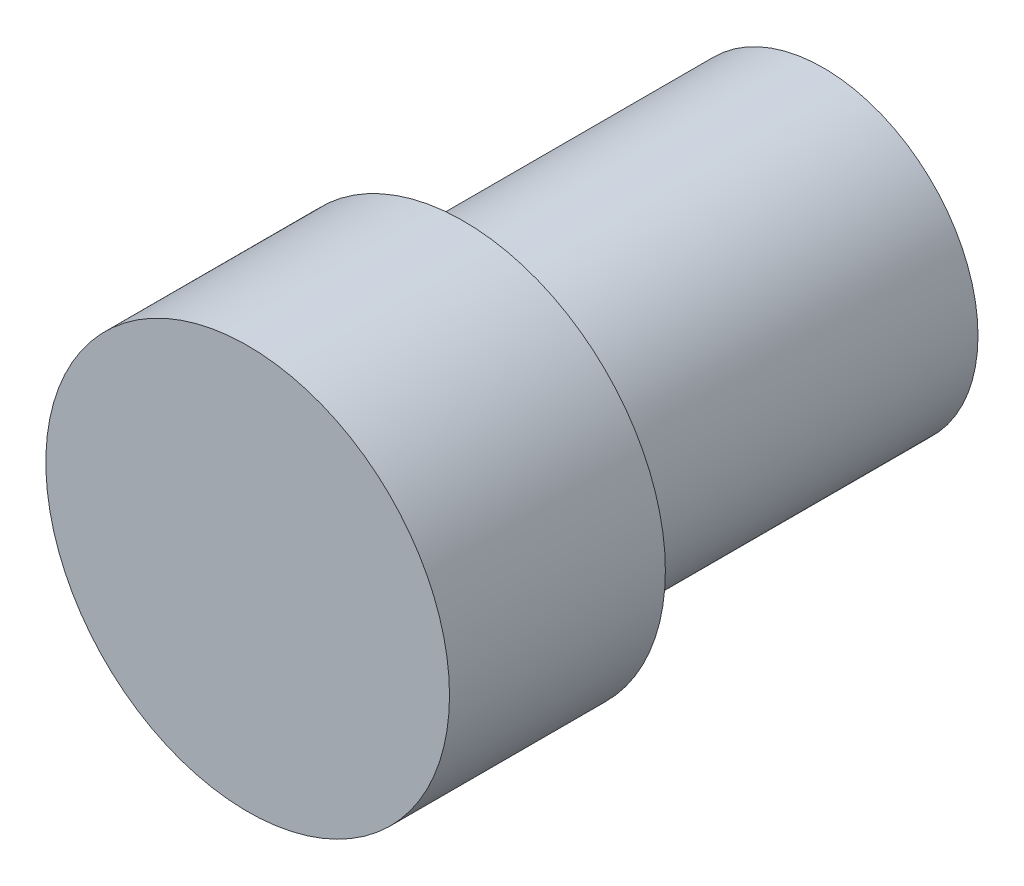
ISO-10303-21;
HEADER;
FILE_DESCRIPTION(('STEP AP214'),'2;1');
FILE_NAME('part.step','',(''),(''),'','','');
FILE_SCHEMA(('AUTOMOTIVE_DESIGN { 1 0 10303 214 1 1 1 1 }'));
ENDSEC;
DATA;
#1=APPLICATION_CONTEXT('core data for automotive mechanical design processes');
#2=APPLICATION_PROTOCOL_DEFINITION('international standard','automotive_design',2000,#1);
#3=PRODUCT_CONTEXT('',#1,'mechanical');
#4=PRODUCT('Part','Part','',(#3));
#5=PRODUCT_RELATED_PRODUCT_CATEGORY('part','',(#4));
#6=PRODUCT_DEFINITION_FORMATION('','',#4);
#7=PRODUCT_DEFINITION_CONTEXT('part definition',#1,'design');
#8=PRODUCT_DEFINITION('design','',#6,#7);
#9=PRODUCT_DEFINITION_SHAPE('','',#8);
#10=(LENGTH_UNIT() NAMED_UNIT(*) SI_UNIT(.MILLI.,.METRE.));
#11=(NAMED_UNIT(*) PLANE_ANGLE_UNIT() SI_UNIT($,.RADIAN.));
#12=(NAMED_UNIT(*) SI_UNIT($,.STERADIAN.) SOLID_ANGLE_UNIT());
#13=UNCERTAINTY_MEASURE_WITH_UNIT(LENGTH_MEASURE(1.E-05),#10,'distance_accuracy_value','');
#14=(GEOMETRIC_REPRESENTATION_CONTEXT(3) GLOBAL_UNCERTAINTY_ASSIGNED_CONTEXT((#13)) GLOBAL_UNIT_ASSIGNED_CONTEXT((#10,
#11,#12)) REPRESENTATION_CONTEXT('',''));
#15=CARTESIAN_POINT('',(0.,0.,0.));
#16=DIRECTION('',(0.,0.,1.));
#17=DIRECTION('',(1.,0.,0.));
#18=AXIS2_PLACEMENT_3D('',#15,#16,#17);
#19=CARTESIAN_POINT('',(0.,0.,12.7));
#20=DIRECTION('',(0.,0.,-0.999999999999999));
#21=DIRECTION('',(-0.999999999999997,0.,0.));
#22=AXIS2_PLACEMENT_3D('',#19,#20,#21);
#23=CYLINDRICAL_SURFACE('',#22,5.461);
#24=CARTESIAN_POINT('',(0.,0.,12.7));
#25=DIRECTION('',(0.,0.,0.999999999999999));
#26=DIRECTION('',(0.999999999999997,0.,0.));
#27=AXIS2_PLACEMENT_3D('',#24,#25,#26);
#28=CIRCLE('',#27,5.461);
#29=CARTESIAN_POINT('',(5.46099999999995,0.,12.7));
#30=VERTEX_POINT('',#29);
#31=EDGE_CURVE('E12',#30,#30,#28,.T.);
#32=ORIENTED_EDGE('',*,*,#31,.F.);
#33=EDGE_LOOP('',(#32));
#34=FACE_BOUND('',#33,.T.);
#35=CARTESIAN_POINT('',(0.,0.,0.));
#36=DIRECTION('',(0.,0.,0.999999999999999));
#37=DIRECTION('',(0.999999999999997,0.,0.));
#38=AXIS2_PLACEMENT_3D('',#35,#36,#37);
#39=CIRCLE('',#38,5.461);
#40=CARTESIAN_POINT('',(5.46099999999998,0.,0.));
#41=VERTEX_POINT('',#40);
#42=EDGE_CURVE('E49',#41,#41,#39,.T.);
#43=ORIENTED_EDGE('',*,*,#42,.T.);
#44=EDGE_LOOP('',(#43));
#45=FACE_BOUND('',#44,.T.);
#46=ADVANCED_FACE('F46',(#34,#45),#23,.T.);
#47=CARTESIAN_POINT('',(0.,0.,0.));
#48=DIRECTION('',(0.,0.,0.999999999999999));
#49=DIRECTION('',(0.999999999999997,0.,0.));
#50=AXIS2_PLACEMENT_3D('',#47,#48,#49);
#51=PLANE('',#50);
#52=ORIENTED_EDGE('',*,*,#42,.F.);
#53=EDGE_LOOP('',(#52));
#54=FACE_BOUND('',#53,.T.);
#55=ADVANCED_FACE('F74',(#54),#51,.F.);
#56=CARTESIAN_POINT('',(0.,0.,12.7));
#57=DIRECTION('',(0.,0.,0.999999999999999));
#58=DIRECTION('',(0.999999999999997,0.,0.));
#59=AXIS2_PLACEMENT_3D('',#56,#57,#58);
#60=PLANE('',#59);
#61=CARTESIAN_POINT('',(0.,0.,12.7));
#62=DIRECTION('',(0.,0.,0.999999999999999));
#63=DIRECTION('',(0.999999999999997,0.,0.));
#64=AXIS2_PLACEMENT_3D('',#61,#62,#63);
#65=CIRCLE('',#64,7.1250920688283);
#66=CARTESIAN_POINT('',(7.12509206882825,0.,12.7));
#67=VERTEX_POINT('',#66);
#68=EDGE_CURVE('E58',#67,#67,#65,.T.);
#69=ORIENTED_EDGE('',*,*,#68,.F.);
#70=EDGE_LOOP('',(#69));
#71=FACE_BOUND('',#70,.T.);
#72=ORIENTED_EDGE('',*,*,#31,.T.);
#73=EDGE_LOOP('',(#72));
#74=FACE_BOUND('',#73,.T.);
#75=ADVANCED_FACE('F69',(#71,#74),#60,.F.);
#76=CARTESIAN_POINT('',(0.,0.,20.32));
#77=DIRECTION('',(0.,0.,-0.999999999999999));
#78=DIRECTION('',(-0.999999999999997,0.,0.));
#79=AXIS2_PLACEMENT_3D('',#76,#77,#78);
#80=CYLINDRICAL_SURFACE('',#79,7.1250920688283);
#81=CARTESIAN_POINT('',(0.,0.,20.32));
#82=DIRECTION('',(0.,0.,0.999999999999999));
#83=DIRECTION('',(0.999999999999997,0.,0.));
#84=AXIS2_PLACEMENT_3D('',#81,#82,#83);
#85=CIRCLE('',#84,7.1250920688283);
#86=CARTESIAN_POINT('',(7.12509206882828,0.,20.32));
#87=VERTEX_POINT('',#86);
#88=EDGE_CURVE('E56',#87,#87,#85,.T.);
#89=ORIENTED_EDGE('',*,*,#88,.F.);
#90=EDGE_LOOP('',(#89));
#91=FACE_BOUND('',#90,.T.);
#92=ORIENTED_EDGE('',*,*,#68,.T.);
#93=EDGE_LOOP('',(#92));
#94=FACE_BOUND('',#93,.T.);
#95=ADVANCED_FACE('F66',(#91,#94),#80,.T.);
#96=CARTESIAN_POINT('',(0.,0.,20.32));
#97=DIRECTION('',(0.,0.,0.999999999999999));
#98=DIRECTION('',(0.999999999999997,0.,0.));
#99=AXIS2_PLACEMENT_3D('',#96,#97,#98);
#100=PLANE('',#99);
#101=ORIENTED_EDGE('',*,*,#88,.T.);
#102=EDGE_LOOP('',(#101));
#103=FACE_BOUND('',#102,.T.);
#104=ADVANCED_FACE('F64',(#103),#100,.T.);
#105=CLOSED_SHELL('',(#46,#55,#75,#95,#104));
#106=MANIFOLD_SOLID_BREP('B2',#105);
#107=ADVANCED_BREP_SHAPE_REPRESENTATION('',(#18,#106),#14);
#108=SHAPE_DEFINITION_REPRESENTATION(#9,#107);
ENDSEC;
END-ISO-10303-21;
